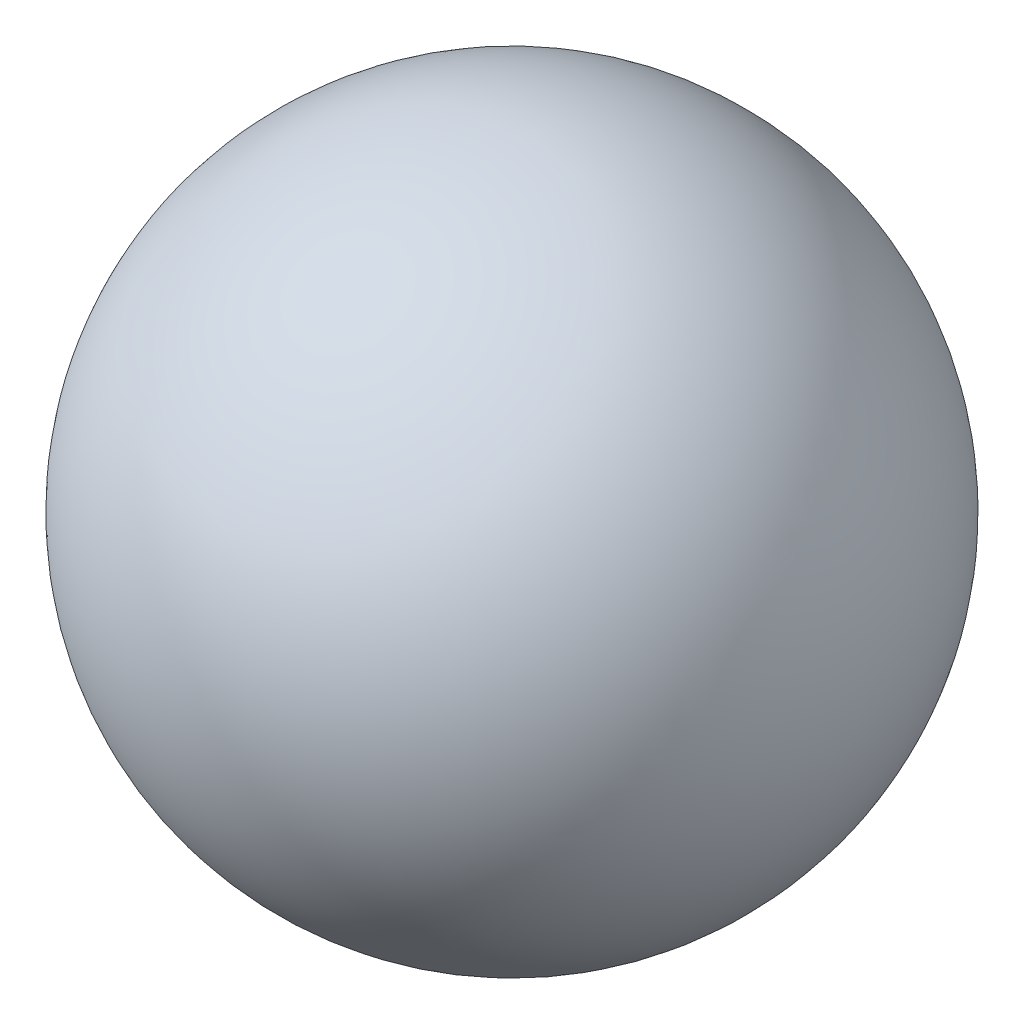
ISO-10303-21;
HEADER;
FILE_DESCRIPTION(('STEP AP214'),'2;1');
FILE_NAME('part.step','',(''),(''),'','','');
FILE_SCHEMA(('AUTOMOTIVE_DESIGN { 1 0 10303 214 1 1 1 1 }'));
ENDSEC;
DATA;
#1=APPLICATION_CONTEXT('core data for automotive mechanical design processes');
#2=APPLICATION_PROTOCOL_DEFINITION('international standard','automotive_design',2000,#1);
#3=PRODUCT_CONTEXT('',#1,'mechanical');
#4=PRODUCT('Part','Part','',(#3));
#5=PRODUCT_RELATED_PRODUCT_CATEGORY('part','',(#4));
#6=PRODUCT_DEFINITION_FORMATION('','',#4);
#7=PRODUCT_DEFINITION_CONTEXT('part definition',#1,'design');
#8=PRODUCT_DEFINITION('design','',#6,#7);
#9=PRODUCT_DEFINITION_SHAPE('','',#8);
#10=(LENGTH_UNIT() NAMED_UNIT(*) SI_UNIT(.MILLI.,.METRE.));
#11=(NAMED_UNIT(*) PLANE_ANGLE_UNIT() SI_UNIT($,.RADIAN.));
#12=(NAMED_UNIT(*) SI_UNIT($,.STERADIAN.) SOLID_ANGLE_UNIT());
#13=UNCERTAINTY_MEASURE_WITH_UNIT(LENGTH_MEASURE(1.E-05),#10,'distance_accuracy_value','');
#14=(GEOMETRIC_REPRESENTATION_CONTEXT(3) GLOBAL_UNCERTAINTY_ASSIGNED_CONTEXT((#13)) GLOBAL_UNIT_ASSIGNED_CONTEXT((#10,
#11,#12)) REPRESENTATION_CONTEXT('',''));
#15=CARTESIAN_POINT('',(0.,0.,0.));
#16=DIRECTION('',(0.,0.,1.));
#17=DIRECTION('',(1.,0.,0.));
#18=AXIS2_PLACEMENT_3D('',#15,#16,#17);
#19=CARTESIAN_POINT('',(0.,0.,0.));
#20=DIRECTION('',(-1.,0.,0.));
#21=DIRECTION('',(0.,1.,0.));
#22=AXIS2_PLACEMENT_3D('',#19,#20,#21);
#23=SPHERICAL_SURFACE('',#22,7.9375);
#24=CARTESIAN_POINT('',(-7.9375,0.,0.));
#25=VERTEX_POINT('',#24);
#26=VERTEX_LOOP('',#25);
#27=FACE_BOUND('',#26,.T.);
#28=ADVANCED_FACE('F35',(#27),#23,.T.);
#29=CLOSED_SHELL('',(#28));
#30=MANIFOLD_SOLID_BREP('B2',#29);
#31=ADVANCED_BREP_SHAPE_REPRESENTATION('',(#18,#30),#14);
#32=SHAPE_DEFINITION_REPRESENTATION(#9,#31);
ENDSEC;
END-ISO-10303-21;
